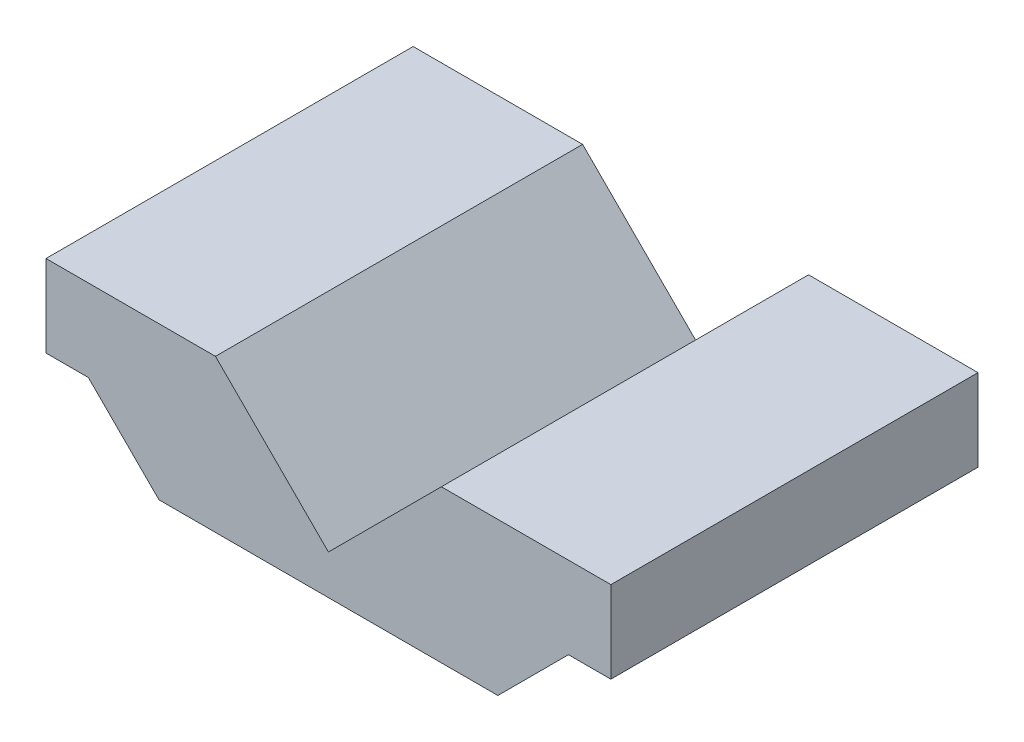
ISO-10303-21;
HEADER;
FILE_DESCRIPTION(('STEP AP214'),'2;1');
FILE_NAME('part.step','',(''),(''),'','','');
FILE_SCHEMA(('AUTOMOTIVE_DESIGN { 1 0 10303 214 1 1 1 1 }'));
ENDSEC;
DATA;
#1=APPLICATION_CONTEXT('core data for automotive mechanical design processes');
#2=APPLICATION_PROTOCOL_DEFINITION('international standard','automotive_design',2000,#1);
#3=PRODUCT_CONTEXT('',#1,'mechanical');
#4=PRODUCT('Part','Part','',(#3));
#5=PRODUCT_RELATED_PRODUCT_CATEGORY('part','',(#4));
#6=PRODUCT_DEFINITION_FORMATION('','',#4);
#7=PRODUCT_DEFINITION_CONTEXT('part definition',#1,'design');
#8=PRODUCT_DEFINITION('design','',#6,#7);
#9=PRODUCT_DEFINITION_SHAPE('','',#8);
#10=(LENGTH_UNIT() NAMED_UNIT(*) SI_UNIT(.MILLI.,.METRE.));
#11=(NAMED_UNIT(*) PLANE_ANGLE_UNIT() SI_UNIT($,.RADIAN.));
#12=(NAMED_UNIT(*) SI_UNIT($,.STERADIAN.) SOLID_ANGLE_UNIT());
#13=UNCERTAINTY_MEASURE_WITH_UNIT(LENGTH_MEASURE(1.E-05),#10,'distance_accuracy_value','');
#14=(GEOMETRIC_REPRESENTATION_CONTEXT(3) GLOBAL_UNCERTAINTY_ASSIGNED_CONTEXT((#13)) GLOBAL_UNIT_ASSIGNED_CONTEXT((#10,
#11,#12)) REPRESENTATION_CONTEXT('',''));
#15=CARTESIAN_POINT('',(0.,0.,0.));
#16=DIRECTION('',(0.,0.,1.));
#17=DIRECTION('',(1.,0.,0.));
#18=AXIS2_PLACEMENT_3D('',#15,#16,#17);
#19=CARTESIAN_POINT('',(-20.,27.,32.5));
#20=DIRECTION('',(-0.707106781186551,-0.707106781186543,0.));
#21=DIRECTION('',(0.707106781186544,-0.707106781186551,0.));
#22=AXIS2_PLACEMENT_3D('',#19,#20,#21);
#23=PLANE('',#22);
#24=DIRECTION('',(-0.707106781186544,0.707106781186551,0.));
#25=VECTOR('',#24,1.);
#26=CARTESIAN_POINT('',(-20.,27.,-32.5));
#27=LINE('',#26,#25);
#28=CARTESIAN_POINT('',(0.,6.99999999999977,-32.5));
#29=VERTEX_POINT('',#28);
#30=CARTESIAN_POINT('',(-20.,27.,-32.5));
#31=VERTEX_POINT('',#30);
#32=EDGE_CURVE('E154',#29,#31,#27,.T.);
#33=ORIENTED_EDGE('',*,*,#32,.T.);
#34=DIRECTION('',(0.,0.,-1.));
#35=VECTOR('',#34,1.);
#36=CARTESIAN_POINT('',(-20.,27.,32.5));
#37=LINE('',#36,#35);
#38=CARTESIAN_POINT('',(-20.,27.,32.5));
#39=VERTEX_POINT('',#38);
#40=EDGE_CURVE('E11',#39,#31,#37,.T.);
#41=ORIENTED_EDGE('',*,*,#40,.F.);
#42=DIRECTION('',(-0.707106781186544,0.707106781186551,0.));
#43=VECTOR('',#42,1.);
#44=CARTESIAN_POINT('',(-20.,27.,32.5));
#45=LINE('',#44,#43);
#46=CARTESIAN_POINT('',(0.,6.99999999999977,32.5));
#47=VERTEX_POINT('',#46);
#48=EDGE_CURVE('E175',#47,#39,#45,.T.);
#49=ORIENTED_EDGE('',*,*,#48,.F.);
#50=DIRECTION('',(0.,0.,-1.));
#51=VECTOR('',#50,1.);
#52=CARTESIAN_POINT('',(0.,6.99999999999977,32.5));
#53=LINE('',#52,#51);
#54=EDGE_CURVE('E150',#47,#29,#53,.T.);
#55=ORIENTED_EDGE('',*,*,#54,.T.);
#56=EDGE_LOOP('',(#33,#41,#49,#55));
#57=FACE_BOUND('',#56,.T.);
#58=ADVANCED_FACE('F37',(#57),#23,.F.);
#59=CARTESIAN_POINT('',(-50.,27.,32.5));
#60=DIRECTION('',(0.,-1.,0.));
#61=DIRECTION('',(0.,0.,-1.));
#62=AXIS2_PLACEMENT_3D('',#59,#60,#61);
#63=PLANE('',#62);
#64=DIRECTION('',(-1.,0.,0.));
#65=VECTOR('',#64,1.);
#66=CARTESIAN_POINT('',(-50.,27.,-32.5));
#67=LINE('',#66,#65);
#68=CARTESIAN_POINT('',(-50.,27.,-32.5));
#69=VERTEX_POINT('',#68);
#70=EDGE_CURVE('E157',#31,#69,#67,.T.);
#71=ORIENTED_EDGE('',*,*,#70,.T.);
#72=DIRECTION('',(0.,0.,-1.));
#73=VECTOR('',#72,1.);
#74=CARTESIAN_POINT('',(-50.,27.,32.5));
#75=LINE('',#74,#73);
#76=CARTESIAN_POINT('',(-50.,27.,32.5));
#77=VERTEX_POINT('',#76);
#78=EDGE_CURVE('E45',#77,#69,#75,.T.);
#79=ORIENTED_EDGE('',*,*,#78,.F.);
#80=DIRECTION('',(-1.,0.,0.));
#81=VECTOR('',#80,1.);
#82=CARTESIAN_POINT('',(-50.,27.,32.5));
#83=LINE('',#82,#81);
#84=EDGE_CURVE('E106',#39,#77,#83,.T.);
#85=ORIENTED_EDGE('',*,*,#84,.F.);
#86=ORIENTED_EDGE('',*,*,#40,.T.);
#87=EDGE_LOOP('',(#71,#79,#85,#86));
#88=FACE_BOUND('',#87,.T.);
#89=ADVANCED_FACE('F247',(#88),#63,.F.);
#90=CARTESIAN_POINT('',(-50.,12.5,32.5));
#91=DIRECTION('',(1.,0.,0.));
#92=DIRECTION('',(0.,0.,-1.));
#93=AXIS2_PLACEMENT_3D('',#90,#91,#92);
#94=PLANE('',#93);
#95=DIRECTION('',(0.,-1.,0.));
#96=VECTOR('',#95,1.);
#97=CARTESIAN_POINT('',(-50.,12.5,-32.5));
#98=LINE('',#97,#96);
#99=CARTESIAN_POINT('',(-50.,12.5,-32.5));
#100=VERTEX_POINT('',#99);
#101=EDGE_CURVE('E160',#69,#100,#98,.T.);
#102=ORIENTED_EDGE('',*,*,#101,.T.);
#103=DIRECTION('',(0.,0.,-1.));
#104=VECTOR('',#103,1.);
#105=CARTESIAN_POINT('',(-50.,12.5,32.5));
#106=LINE('',#105,#104);
#107=CARTESIAN_POINT('',(-50.,12.5,32.5));
#108=VERTEX_POINT('',#107);
#109=EDGE_CURVE('E191',#108,#100,#106,.T.);
#110=ORIENTED_EDGE('',*,*,#109,.F.);
#111=DIRECTION('',(0.,-1.,0.));
#112=VECTOR('',#111,1.);
#113=CARTESIAN_POINT('',(-50.,12.5,32.5));
#114=LINE('',#113,#112);
#115=EDGE_CURVE('E199',#77,#108,#114,.T.);
#116=ORIENTED_EDGE('',*,*,#115,.F.);
#117=ORIENTED_EDGE('',*,*,#78,.T.);
#118=EDGE_LOOP('',(#102,#110,#116,#117));
#119=FACE_BOUND('',#118,.T.);
#120=ADVANCED_FACE('F197',(#119),#94,.F.);
#121=CARTESIAN_POINT('',(-42.5,12.5,32.5));
#122=DIRECTION('',(0.,1.,0.));
#123=DIRECTION('',(0.,0.,1.));
#124=AXIS2_PLACEMENT_3D('',#121,#122,#123);
#125=PLANE('',#124);
#126=DIRECTION('',(1.,0.,0.));
#127=VECTOR('',#126,1.);
#128=CARTESIAN_POINT('',(-42.5,12.5,-32.5));
#129=LINE('',#128,#127);
#130=CARTESIAN_POINT('',(-42.5,12.5,-32.5));
#131=VERTEX_POINT('',#130);
#132=EDGE_CURVE('E162',#100,#131,#129,.T.);
#133=ORIENTED_EDGE('',*,*,#132,.T.);
#134=DIRECTION('',(0.,0.,-1.));
#135=VECTOR('',#134,1.);
#136=CARTESIAN_POINT('',(-42.5,12.5,32.5));
#137=LINE('',#136,#135);
#138=CARTESIAN_POINT('',(-42.5,12.5,32.5));
#139=VERTEX_POINT('',#138);
#140=EDGE_CURVE('E188',#139,#131,#137,.T.);
#141=ORIENTED_EDGE('',*,*,#140,.F.);
#142=DIRECTION('',(1.,0.,0.));
#143=VECTOR('',#142,1.);
#144=CARTESIAN_POINT('',(-42.5,12.5,32.5));
#145=LINE('',#144,#143);
#146=EDGE_CURVE('E217',#108,#139,#145,.T.);
#147=ORIENTED_EDGE('',*,*,#146,.F.);
#148=ORIENTED_EDGE('',*,*,#109,.T.);
#149=EDGE_LOOP('',(#133,#141,#147,#148));
#150=FACE_BOUND('',#149,.T.);
#151=ADVANCED_FACE('F208',(#150),#125,.F.);
#152=CARTESIAN_POINT('',(-30.,0.,32.5));
#153=DIRECTION('',(0.707106781186548,0.707106781186547,0.));
#154=DIRECTION('',(-0.707106781186547,0.707106781186548,0.));
#155=AXIS2_PLACEMENT_3D('',#152,#153,#154);
#156=PLANE('',#155);
#157=CARTESIAN_POINT('',(-33.7250480233555,3.72504802335552,20.));
#158=DIRECTION('',(-0.707106781186548,-0.707106781186547,0.));
#159=DIRECTION('',(0.707106781186547,-0.707106781186548,0.));
#160=AXIS2_PLACEMENT_3D('',#157,#158,#159);
#161=CIRCLE('',#160,3.39999999999999);
#162=CARTESIAN_POINT('',(-31.3208849673213,1.32088496732126,20.));
#163=VERTEX_POINT('',#162);
#164=EDGE_CURVE('E413',#163,#163,#161,.T.);
#165=ORIENTED_EDGE('',*,*,#164,.F.);
#166=EDGE_LOOP('',(#165));
#167=FACE_BOUND('',#166,.T.);
#168=CARTESIAN_POINT('',(-33.7250480233555,3.72504802335552,-20.));
#169=DIRECTION('',(-0.707106781186548,-0.707106781186547,0.));
#170=DIRECTION('',(0.707106781186547,-0.707106781186548,0.));
#171=AXIS2_PLACEMENT_3D('',#168,#169,#170);
#172=CIRCLE('',#171,3.39999999999999);
#173=CARTESIAN_POINT('',(-31.3208849673213,1.32088496732127,-20.));
#174=VERTEX_POINT('',#173);
#175=EDGE_CURVE('E415',#174,#174,#172,.T.);
#176=ORIENTED_EDGE('',*,*,#175,.F.);
#177=EDGE_LOOP('',(#176));
#178=FACE_BOUND('',#177,.T.);
#179=DIRECTION('',(0.707106781186547,-0.707106781186548,0.));
#180=VECTOR('',#179,1.);
#181=CARTESIAN_POINT('',(-30.,0.,-32.5));
#182=LINE('',#181,#180);
#183=CARTESIAN_POINT('',(-30.,0.,-32.5));
#184=VERTEX_POINT('',#183);
#185=EDGE_CURVE('E164',#131,#184,#182,.T.);
#186=ORIENTED_EDGE('',*,*,#185,.T.);
#187=DIRECTION('',(0.,0.,-1.));
#188=VECTOR('',#187,1.);
#189=CARTESIAN_POINT('',(-30.,0.,32.5));
#190=LINE('',#189,#188);
#191=CARTESIAN_POINT('',(-30.,0.,32.5));
#192=VERTEX_POINT('',#191);
#193=EDGE_CURVE('E185',#192,#184,#190,.T.);
#194=ORIENTED_EDGE('',*,*,#193,.F.);
#195=DIRECTION('',(0.707106781186547,-0.707106781186548,0.));
#196=VECTOR('',#195,1.);
#197=CARTESIAN_POINT('',(-30.,0.,32.5));
#198=LINE('',#197,#196);
#199=EDGE_CURVE('E214',#139,#192,#198,.T.);
#200=ORIENTED_EDGE('',*,*,#199,.F.);
#201=ORIENTED_EDGE('',*,*,#140,.T.);
#202=EDGE_LOOP('',(#186,#194,#200,#201));
#203=FACE_BOUND('',#202,.T.);
#204=ADVANCED_FACE('F212',(#167,#178,#203),#156,.F.);
#205=CARTESIAN_POINT('',(-30.,0.,32.5));
#206=DIRECTION('',(0.,1.,0.));
#207=DIRECTION('',(0.,0.,1.));
#208=AXIS2_PLACEMENT_3D('',#205,#206,#207);
#209=PLANE('',#208);
#210=DIRECTION('',(1.,0.,0.));
#211=VECTOR('',#210,1.);
#212=CARTESIAN_POINT('',(-30.,0.,-32.5));
#213=LINE('',#212,#211);
#214=CARTESIAN_POINT('',(30.,0.,-32.5));
#215=VERTEX_POINT('',#214);
#216=EDGE_CURVE('E166',#184,#215,#213,.T.);
#217=ORIENTED_EDGE('',*,*,#216,.T.);
#218=DIRECTION('',(0.,0.,-1.));
#219=VECTOR('',#218,1.);
#220=CARTESIAN_POINT('',(30.,0.,32.5));
#221=LINE('',#220,#219);
#222=CARTESIAN_POINT('',(30.,0.,32.5));
#223=VERTEX_POINT('',#222);
#224=EDGE_CURVE('E182',#223,#215,#221,.T.);
#225=ORIENTED_EDGE('',*,*,#224,.F.);
#226=DIRECTION('',(1.,0.,0.));
#227=VECTOR('',#226,1.);
#228=CARTESIAN_POINT('',(-30.,0.,32.5));
#229=LINE('',#228,#227);
#230=EDGE_CURVE('E216',#192,#223,#229,.T.);
#231=ORIENTED_EDGE('',*,*,#230,.F.);
#232=ORIENTED_EDGE('',*,*,#193,.T.);
#233=EDGE_LOOP('',(#217,#225,#231,#232));
#234=FACE_BOUND('',#233,.T.);
#235=ADVANCED_FACE('F260',(#234),#209,.F.);
#236=CARTESIAN_POINT('',(30.,0.,32.5));
#237=DIRECTION('',(-0.707106781186548,0.707106781186547,0.));
#238=DIRECTION('',(-0.707106781186547,-0.707106781186548,0.));
#239=AXIS2_PLACEMENT_3D('',#236,#237,#238);
#240=PLANE('',#239);
#241=CARTESIAN_POINT('',(33.7250480233555,3.72504802335552,20.));
#242=DIRECTION('',(0.707106781186548,-0.707106781186547,0.));
#243=DIRECTION('',(0.707106781186547,0.707106781186548,0.));
#244=AXIS2_PLACEMENT_3D('',#241,#242,#243);
#245=CIRCLE('',#244,3.39999999999999);
#246=CARTESIAN_POINT('',(36.1292110793898,6.12921107938977,20.));
#247=VERTEX_POINT('',#246);
#248=EDGE_CURVE('E423',#247,#247,#245,.T.);
#249=ORIENTED_EDGE('',*,*,#248,.F.);
#250=EDGE_LOOP('',(#249));
#251=FACE_BOUND('',#250,.T.);
#252=CARTESIAN_POINT('',(33.7250480233555,3.72504802335552,-20.));
#253=DIRECTION('',(0.707106781186548,-0.707106781186547,0.));
#254=DIRECTION('',(0.707106781186547,0.707106781186548,0.));
#255=AXIS2_PLACEMENT_3D('',#252,#253,#254);
#256=CIRCLE('',#255,3.39999999999999);
#257=CARTESIAN_POINT('',(36.1292110793898,6.12921107938978,-20.));
#258=VERTEX_POINT('',#257);
#259=EDGE_CURVE('E429',#258,#258,#256,.T.);
#260=ORIENTED_EDGE('',*,*,#259,.F.);
#261=EDGE_LOOP('',(#260));
#262=FACE_BOUND('',#261,.T.);
#263=DIRECTION('',(0.707106781186547,0.707106781186548,0.));
#264=VECTOR('',#263,1.);
#265=CARTESIAN_POINT('',(30.,0.,-32.5));
#266=LINE('',#265,#264);
#267=CARTESIAN_POINT('',(42.5,12.5,-32.5));
#268=VERTEX_POINT('',#267);
#269=EDGE_CURVE('E168',#215,#268,#266,.T.);
#270=ORIENTED_EDGE('',*,*,#269,.T.);
#271=DIRECTION('',(0.,0.,-1.));
#272=VECTOR('',#271,1.);
#273=CARTESIAN_POINT('',(42.5,12.5,32.5));
#274=LINE('',#273,#272);
#275=CARTESIAN_POINT('',(42.5,12.5,32.5));
#276=VERTEX_POINT('',#275);
#277=EDGE_CURVE('E179',#276,#268,#274,.T.);
#278=ORIENTED_EDGE('',*,*,#277,.F.);
#279=DIRECTION('',(0.707106781186547,0.707106781186548,0.));
#280=VECTOR('',#279,1.);
#281=CARTESIAN_POINT('',(30.,0.,32.5));
#282=LINE('',#281,#280);
#283=EDGE_CURVE('E219',#223,#276,#282,.T.);
#284=ORIENTED_EDGE('',*,*,#283,.F.);
#285=ORIENTED_EDGE('',*,*,#224,.T.);
#286=EDGE_LOOP('',(#270,#278,#284,#285));
#287=FACE_BOUND('',#286,.T.);
#288=ADVANCED_FACE('F228',(#251,#262,#287),#240,.F.);
#289=CARTESIAN_POINT('',(42.5,12.5,32.5));
#290=DIRECTION('',(0.,1.,0.));
#291=DIRECTION('',(0.,0.,1.));
#292=AXIS2_PLACEMENT_3D('',#289,#290,#291);
#293=PLANE('',#292);
#294=DIRECTION('',(1.,0.,0.));
#295=VECTOR('',#294,1.);
#296=CARTESIAN_POINT('',(42.5,12.5,-32.5));
#297=LINE('',#296,#295);
#298=CARTESIAN_POINT('',(50.,12.5,-32.5));
#299=VERTEX_POINT('',#298);
#300=EDGE_CURVE('E170',#268,#299,#297,.T.);
#301=ORIENTED_EDGE('',*,*,#300,.T.);
#302=DIRECTION('',(0.,0.,-1.));
#303=VECTOR('',#302,1.);
#304=CARTESIAN_POINT('',(50.,12.5,32.5));
#305=LINE('',#304,#303);
#306=CARTESIAN_POINT('',(50.,12.5,32.5));
#307=VERTEX_POINT('',#306);
#308=EDGE_CURVE('E145',#307,#299,#305,.T.);
#309=ORIENTED_EDGE('',*,*,#308,.F.);
#310=DIRECTION('',(1.,0.,0.));
#311=VECTOR('',#310,1.);
#312=CARTESIAN_POINT('',(42.5,12.5,32.5));
#313=LINE('',#312,#311);
#314=EDGE_CURVE('E136',#276,#307,#313,.T.);
#315=ORIENTED_EDGE('',*,*,#314,.F.);
#316=ORIENTED_EDGE('',*,*,#277,.T.);
#317=EDGE_LOOP('',(#301,#309,#315,#316));
#318=FACE_BOUND('',#317,.T.);
#319=ADVANCED_FACE('F232',(#318),#293,.F.);
#320=CARTESIAN_POINT('',(50.,12.5,32.5));
#321=DIRECTION('',(-1.,0.,0.));
#322=DIRECTION('',(0.,0.,1.));
#323=AXIS2_PLACEMENT_3D('',#320,#321,#322);
#324=PLANE('',#323);
#325=DIRECTION('',(0.,1.,0.));
#326=VECTOR('',#325,1.);
#327=CARTESIAN_POINT('',(50.,12.5,-32.5));
#328=LINE('',#327,#326);
#329=CARTESIAN_POINT('',(50.,27.,-32.5));
#330=VERTEX_POINT('',#329);
#331=EDGE_CURVE('E144',#299,#330,#328,.T.);
#332=ORIENTED_EDGE('',*,*,#331,.T.);
#333=DIRECTION('',(0.,0.,-1.));
#334=VECTOR('',#333,1.);
#335=CARTESIAN_POINT('',(50.,27.,32.5));
#336=LINE('',#335,#334);
#337=CARTESIAN_POINT('',(50.,27.,32.5));
#338=VERTEX_POINT('',#337);
#339=EDGE_CURVE('E141',#338,#330,#336,.T.);
#340=ORIENTED_EDGE('',*,*,#339,.F.);
#341=DIRECTION('',(0.,1.,0.));
#342=VECTOR('',#341,1.);
#343=CARTESIAN_POINT('',(50.,12.5,32.5));
#344=LINE('',#343,#342);
#345=EDGE_CURVE('E130',#307,#338,#344,.T.);
#346=ORIENTED_EDGE('',*,*,#345,.F.);
#347=ORIENTED_EDGE('',*,*,#308,.T.);
#348=EDGE_LOOP('',(#332,#340,#346,#347));
#349=FACE_BOUND('',#348,.T.);
#350=ADVANCED_FACE('F142',(#349),#324,.F.);
#351=CARTESIAN_POINT('',(50.,27.,32.5));
#352=DIRECTION('',(0.,-1.,0.));
#353=DIRECTION('',(0.,0.,-1.));
#354=AXIS2_PLACEMENT_3D('',#351,#352,#353);
#355=PLANE('',#354);
#356=DIRECTION('',(-1.,0.,0.));
#357=VECTOR('',#356,1.);
#358=CARTESIAN_POINT('',(50.,27.,-32.5));
#359=LINE('',#358,#357);
#360=CARTESIAN_POINT('',(20.,27.,-32.5));
#361=VERTEX_POINT('',#360);
#362=EDGE_CURVE('E92',#330,#361,#359,.T.);
#363=ORIENTED_EDGE('',*,*,#362,.T.);
#364=DIRECTION('',(0.,0.,-1.));
#365=VECTOR('',#364,1.);
#366=CARTESIAN_POINT('',(20.,27.,32.5));
#367=LINE('',#366,#365);
#368=CARTESIAN_POINT('',(20.,27.,32.5));
#369=VERTEX_POINT('',#368);
#370=EDGE_CURVE('E146',#369,#361,#367,.T.);
#371=ORIENTED_EDGE('',*,*,#370,.F.);
#372=DIRECTION('',(-1.,0.,0.));
#373=VECTOR('',#372,1.);
#374=CARTESIAN_POINT('',(50.,27.,32.5));
#375=LINE('',#374,#373);
#376=EDGE_CURVE('E134',#338,#369,#375,.T.);
#377=ORIENTED_EDGE('',*,*,#376,.F.);
#378=ORIENTED_EDGE('',*,*,#339,.T.);
#379=EDGE_LOOP('',(#363,#371,#377,#378));
#380=FACE_BOUND('',#379,.T.);
#381=ADVANCED_FACE('F148',(#380),#355,.F.);
#382=CARTESIAN_POINT('',(20.,27.,32.5));
#383=DIRECTION('',(0.707106781186551,-0.707106781186543,0.));
#384=DIRECTION('',(0.707106781186544,0.707106781186551,0.));
#385=AXIS2_PLACEMENT_3D('',#382,#383,#384);
#386=PLANE('',#385);
#387=DIRECTION('',(-0.707106781186544,-0.707106781186551,0.));
#388=VECTOR('',#387,1.);
#389=CARTESIAN_POINT('',(20.,27.,-32.5));
#390=LINE('',#389,#388);
#391=EDGE_CURVE('E98',#361,#29,#390,.T.);
#392=ORIENTED_EDGE('',*,*,#391,.T.);
#393=ORIENTED_EDGE('',*,*,#54,.F.);
#394=DIRECTION('',(-0.707106781186544,-0.707106781186551,0.));
#395=VECTOR('',#394,1.);
#396=CARTESIAN_POINT('',(20.,27.,32.5));
#397=LINE('',#396,#395);
#398=EDGE_CURVE('E53',#369,#47,#397,.T.);
#399=ORIENTED_EDGE('',*,*,#398,.F.);
#400=ORIENTED_EDGE('',*,*,#370,.T.);
#401=EDGE_LOOP('',(#392,#393,#399,#400));
#402=FACE_BOUND('',#401,.T.);
#403=ADVANCED_FACE('F236',(#402),#386,.F.);
#404=CARTESIAN_POINT('',(0.,0.,32.5));
#405=DIRECTION('',(0.,0.,-1.));
#406=DIRECTION('',(-1.,0.,0.));
#407=AXIS2_PLACEMENT_3D('',#404,#405,#406);
#408=PLANE('',#407);
#409=ORIENTED_EDGE('',*,*,#48,.T.);
#410=ORIENTED_EDGE('',*,*,#84,.T.);
#411=ORIENTED_EDGE('',*,*,#115,.T.);
#412=ORIENTED_EDGE('',*,*,#146,.T.);
#413=ORIENTED_EDGE('',*,*,#199,.T.);
#414=ORIENTED_EDGE('',*,*,#230,.T.);
#415=ORIENTED_EDGE('',*,*,#283,.T.);
#416=ORIENTED_EDGE('',*,*,#314,.T.);
#417=ORIENTED_EDGE('',*,*,#345,.T.);
#418=ORIENTED_EDGE('',*,*,#376,.T.);
#419=ORIENTED_EDGE('',*,*,#398,.T.);
#420=EDGE_LOOP('',(#409,#410,#411,#412,#413,#414,#415,#416,#417,#418,#419));
#421=FACE_BOUND('',#420,.T.);
#422=ADVANCED_FACE('F132',(#421),#408,.F.);
#423=CARTESIAN_POINT('',(0.,0.,-32.5));
#424=DIRECTION('',(0.,0.,-1.));
#425=DIRECTION('',(-1.,0.,0.));
#426=AXIS2_PLACEMENT_3D('',#423,#424,#425);
#427=PLANE('',#426);
#428=ORIENTED_EDGE('',*,*,#32,.F.);
#429=ORIENTED_EDGE('',*,*,#391,.F.);
#430=ORIENTED_EDGE('',*,*,#362,.F.);
#431=ORIENTED_EDGE('',*,*,#331,.F.);
#432=ORIENTED_EDGE('',*,*,#300,.F.);
#433=ORIENTED_EDGE('',*,*,#269,.F.);
#434=ORIENTED_EDGE('',*,*,#216,.F.);
#435=ORIENTED_EDGE('',*,*,#185,.F.);
#436=ORIENTED_EDGE('',*,*,#132,.F.);
#437=ORIENTED_EDGE('',*,*,#101,.F.);
#438=ORIENTED_EDGE('',*,*,#70,.F.);
#439=EDGE_LOOP('',(#428,#429,#430,#431,#432,#433,#434,#435,#436,#437,#438));
#440=FACE_BOUND('',#439,.T.);
#441=ADVANCED_FACE('F203',(#440),#427,.T.);
#442=CARTESIAN_POINT('',(19.5829123996246,17.8671836470865,-20.));
#443=DIRECTION('',(0.707106781186548,-0.707106781186547,0.));
#444=DIRECTION('',(0.707106781186547,0.707106781186548,0.));
#445=AXIS2_PLACEMENT_3D('',#442,#443,#444);
#446=CONICAL_SURFACE('',#445,3.39999999999999,1.02974425867665);
#447=CARTESIAN_POINT('',(18.1383454975326,19.3117505491784,-20.));
#448=VERTEX_POINT('',#447);
#449=VERTEX_LOOP('',#448);
#450=FACE_BOUND('',#449,.T.);
#451=CARTESIAN_POINT('',(19.5829123996246,17.8671836470865,-20.));
#452=DIRECTION('',(0.707106781186548,-0.707106781186547,0.));
#453=DIRECTION('',(0.707106781186547,0.707106781186548,0.));
#454=AXIS2_PLACEMENT_3D('',#451,#452,#453);
#455=CIRCLE('',#454,3.39999999999999);
#456=CARTESIAN_POINT('',(21.9870754556588,20.2713467031207,-20.));
#457=VERTEX_POINT('',#456);
#458=EDGE_CURVE('E158',#457,#457,#455,.T.);
#459=ORIENTED_EDGE('',*,*,#458,.T.);
#460=EDGE_LOOP('',(#459));
#461=FACE_BOUND('',#460,.T.);
#462=ADVANCED_FACE('F298',(#450,#461),#446,.F.);
#463=CARTESIAN_POINT('',(33.7250480233555,3.72504802335552,-20.));
#464=DIRECTION('',(0.707106781186548,-0.707106781186547,0.));
#465=DIRECTION('',(0.707106781186547,0.707106781186548,0.));
#466=AXIS2_PLACEMENT_3D('',#463,#464,#465);
#467=CYLINDRICAL_SURFACE('',#466,3.39999999999999);
#468=ORIENTED_EDGE('',*,*,#458,.F.);
#469=EDGE_LOOP('',(#468));
#470=FACE_BOUND('',#469,.T.);
#471=ORIENTED_EDGE('',*,*,#259,.T.);
#472=EDGE_LOOP('',(#471));
#473=FACE_BOUND('',#472,.T.);
#474=ADVANCED_FACE('F314',(#470,#473),#467,.F.);
#475=CARTESIAN_POINT('',(19.5829123996246,17.8671836470865,20.));
#476=DIRECTION('',(0.707106781186548,-0.707106781186547,0.));
#477=DIRECTION('',(0.707106781186547,0.707106781186548,0.));
#478=AXIS2_PLACEMENT_3D('',#475,#476,#477);
#479=CONICAL_SURFACE('',#478,3.39999999999999,1.02974425867665);
#480=CARTESIAN_POINT('',(18.1383454975326,19.3117505491784,20.));
#481=VERTEX_POINT('',#480);
#482=VERTEX_LOOP('',#481);
#483=FACE_BOUND('',#482,.T.);
#484=CARTESIAN_POINT('',(19.5829123996246,17.8671836470865,20.));
#485=DIRECTION('',(0.707106781186548,-0.707106781186547,0.));
#486=DIRECTION('',(0.707106781186547,0.707106781186548,0.));
#487=AXIS2_PLACEMENT_3D('',#484,#485,#486);
#488=CIRCLE('',#487,3.39999999999999);
#489=CARTESIAN_POINT('',(21.9870754556588,20.2713467031207,20.));
#490=VERTEX_POINT('',#489);
#491=EDGE_CURVE('E426',#490,#490,#488,.T.);
#492=ORIENTED_EDGE('',*,*,#491,.T.);
#493=EDGE_LOOP('',(#492));
#494=FACE_BOUND('',#493,.T.);
#495=ADVANCED_FACE('F325',(#483,#494),#479,.F.);
#496=CARTESIAN_POINT('',(33.7250480233555,3.72504802335552,20.));
#497=DIRECTION('',(0.707106781186548,-0.707106781186547,0.));
#498=DIRECTION('',(0.707106781186547,0.707106781186548,0.));
#499=AXIS2_PLACEMENT_3D('',#496,#497,#498);
#500=CYLINDRICAL_SURFACE('',#499,3.39999999999999);
#501=ORIENTED_EDGE('',*,*,#491,.F.);
#502=EDGE_LOOP('',(#501));
#503=FACE_BOUND('',#502,.T.);
#504=ORIENTED_EDGE('',*,*,#248,.T.);
#505=EDGE_LOOP('',(#504));
#506=FACE_BOUND('',#505,.T.);
#507=ADVANCED_FACE('F337',(#503,#506),#500,.F.);
#508=CARTESIAN_POINT('',(-19.5829123996246,17.8671836470865,-20.));
#509=DIRECTION('',(-0.707106781186548,-0.707106781186547,0.));
#510=DIRECTION('',(0.707106781186547,-0.707106781186548,0.));
#511=AXIS2_PLACEMENT_3D('',#508,#509,#510);
#512=CONICAL_SURFACE('',#511,3.39999999999999,1.02974425867665);
#513=CARTESIAN_POINT('',(-18.1383454975326,19.3117505491784,-20.));
#514=VERTEX_POINT('',#513);
#515=VERTEX_LOOP('',#514);
#516=FACE_BOUND('',#515,.T.);
#517=CARTESIAN_POINT('',(-19.5829123996246,17.8671836470865,-20.));
#518=DIRECTION('',(-0.707106781186548,-0.707106781186547,0.));
#519=DIRECTION('',(0.707106781186547,-0.707106781186548,0.));
#520=AXIS2_PLACEMENT_3D('',#517,#518,#519);
#521=CIRCLE('',#520,3.39999999999999);
#522=CARTESIAN_POINT('',(-17.1787493435903,15.4630205910522,-20.));
#523=VERTEX_POINT('',#522);
#524=EDGE_CURVE('E420',#523,#523,#521,.T.);
#525=ORIENTED_EDGE('',*,*,#524,.T.);
#526=EDGE_LOOP('',(#525));
#527=FACE_BOUND('',#526,.T.);
#528=ADVANCED_FACE('F347',(#516,#527),#512,.F.);
#529=CARTESIAN_POINT('',(-33.7250480233555,3.72504802335552,-20.));
#530=DIRECTION('',(-0.707106781186548,-0.707106781186547,0.));
#531=DIRECTION('',(0.707106781186547,-0.707106781186548,0.));
#532=AXIS2_PLACEMENT_3D('',#529,#530,#531);
#533=CYLINDRICAL_SURFACE('',#532,3.39999999999999);
#534=ORIENTED_EDGE('',*,*,#524,.F.);
#535=EDGE_LOOP('',(#534));
#536=FACE_BOUND('',#535,.T.);
#537=ORIENTED_EDGE('',*,*,#175,.T.);
#538=EDGE_LOOP('',(#537));
#539=FACE_BOUND('',#538,.T.);
#540=ADVANCED_FACE('F366',(#536,#539),#533,.F.);
#541=CARTESIAN_POINT('',(-19.5829123996246,17.8671836470865,20.));
#542=DIRECTION('',(-0.707106781186548,-0.707106781186547,0.));
#543=DIRECTION('',(0.707106781186547,-0.707106781186548,0.));
#544=AXIS2_PLACEMENT_3D('',#541,#542,#543);
#545=CONICAL_SURFACE('',#544,3.39999999999999,1.02974425867665);
#546=CARTESIAN_POINT('',(-18.1383454975326,19.3117505491784,20.));
#547=VERTEX_POINT('',#546);
#548=VERTEX_LOOP('',#547);
#549=FACE_BOUND('',#548,.T.);
#550=CARTESIAN_POINT('',(-19.5829123996246,17.8671836470865,20.));
#551=DIRECTION('',(-0.707106781186548,-0.707106781186547,0.));
#552=DIRECTION('',(0.707106781186547,-0.707106781186548,0.));
#553=AXIS2_PLACEMENT_3D('',#550,#551,#552);
#554=CIRCLE('',#553,3.39999999999999);
#555=CARTESIAN_POINT('',(-17.1787493435903,15.4630205910522,20.));
#556=VERTEX_POINT('',#555);
#557=EDGE_CURVE('E410',#556,#556,#554,.T.);
#558=ORIENTED_EDGE('',*,*,#557,.T.);
#559=EDGE_LOOP('',(#558));
#560=FACE_BOUND('',#559,.T.);
#561=ADVANCED_FACE('F377',(#549,#560),#545,.F.);
#562=CARTESIAN_POINT('',(-33.7250480233555,3.72504802335552,20.));
#563=DIRECTION('',(-0.707106781186548,-0.707106781186547,0.));
#564=DIRECTION('',(0.707106781186547,-0.707106781186548,0.));
#565=AXIS2_PLACEMENT_3D('',#562,#563,#564);
#566=CYLINDRICAL_SURFACE('',#565,3.39999999999999);
#567=ORIENTED_EDGE('',*,*,#557,.F.);
#568=EDGE_LOOP('',(#567));
#569=FACE_BOUND('',#568,.T.);
#570=ORIENTED_EDGE('',*,*,#164,.T.);
#571=EDGE_LOOP('',(#570));
#572=FACE_BOUND('',#571,.T.);
#573=ADVANCED_FACE('F388',(#569,#572),#566,.F.);
#574=CLOSED_SHELL('',(#58,#89,#120,#151,#204,#235,#288,#319,#350,#381,#403,#422,#441,#462,#474,
#495,#507,#528,#540,#561,#573));
#575=MANIFOLD_SOLID_BREP('B2',#574);
#576=ADVANCED_BREP_SHAPE_REPRESENTATION('',(#18,#575),#14);
#577=SHAPE_DEFINITION_REPRESENTATION(#9,#576);
ENDSEC;
END-ISO-10303-21;
